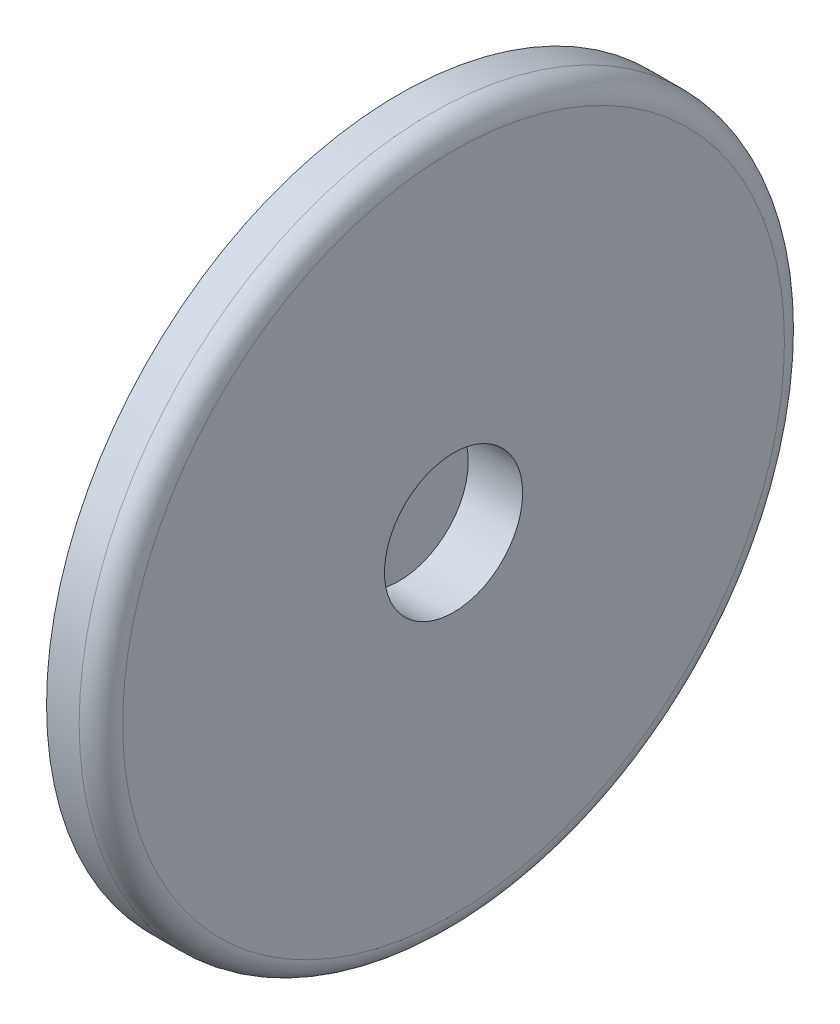
ISO-10303-21;
HEADER;
FILE_DESCRIPTION(('STEP AP214'),'2;1');
FILE_NAME('part.step','',(''),(''),'','','');
FILE_SCHEMA(('AUTOMOTIVE_DESIGN { 1 0 10303 214 1 1 1 1 }'));
ENDSEC;
DATA;
#1=APPLICATION_CONTEXT('core data for automotive mechanical design processes');
#2=APPLICATION_PROTOCOL_DEFINITION('international standard','automotive_design',2000,#1);
#3=PRODUCT_CONTEXT('',#1,'mechanical');
#4=PRODUCT('Part','Part','',(#3));
#5=PRODUCT_RELATED_PRODUCT_CATEGORY('part','',(#4));
#6=PRODUCT_DEFINITION_FORMATION('','',#4);
#7=PRODUCT_DEFINITION_CONTEXT('part definition',#1,'design');
#8=PRODUCT_DEFINITION('design','',#6,#7);
#9=PRODUCT_DEFINITION_SHAPE('','',#8);
#10=(LENGTH_UNIT() NAMED_UNIT(*) SI_UNIT(.MILLI.,.METRE.));
#11=(NAMED_UNIT(*) PLANE_ANGLE_UNIT() SI_UNIT($,.RADIAN.));
#12=(NAMED_UNIT(*) SI_UNIT($,.STERADIAN.) SOLID_ANGLE_UNIT());
#13=UNCERTAINTY_MEASURE_WITH_UNIT(LENGTH_MEASURE(1.E-05),#10,'distance_accuracy_value','');
#14=(GEOMETRIC_REPRESENTATION_CONTEXT(3) GLOBAL_UNCERTAINTY_ASSIGNED_CONTEXT((#13)) GLOBAL_UNIT_ASSIGNED_CONTEXT((#10,
#11,#12)) REPRESENTATION_CONTEXT('',''));
#15=CARTESIAN_POINT('',(0.,0.,0.));
#16=DIRECTION('',(0.,0.,1.));
#17=DIRECTION('',(1.,0.,0.));
#18=AXIS2_PLACEMENT_3D('',#15,#16,#17);
#19=CARTESIAN_POINT('',(10.,0.,0.));
#20=DIRECTION('',(-1.,0.,0.));
#21=DIRECTION('',(0.,0.,1.));
#22=AXIS2_PLACEMENT_3D('',#19,#20,#21);
#23=CYLINDRICAL_SURFACE('',#22,51.15);
#24=CARTESIAN_POINT('',(0.999999999999999,0.,0.));
#25=DIRECTION('',(1.,0.,0.));
#26=DIRECTION('',(0.,0.,-1.));
#27=AXIS2_PLACEMENT_3D('',#24,#25,#26);
#28=CIRCLE('',#27,51.15);
#29=CARTESIAN_POINT('',(0.999999999999999,0.,-51.15));
#30=VERTEX_POINT('',#29);
#31=EDGE_CURVE('E46',#30,#30,#28,.T.);
#32=ORIENTED_EDGE('',*,*,#31,.T.);
#33=EDGE_LOOP('',(#32));
#34=FACE_BOUND('',#33,.T.);
#35=CARTESIAN_POINT('',(10.,0.,0.));
#36=DIRECTION('',(1.,0.,0.));
#37=DIRECTION('',(0.,0.,-1.));
#38=AXIS2_PLACEMENT_3D('',#35,#36,#37);
#39=CIRCLE('',#38,51.15);
#40=CARTESIAN_POINT('',(10.,0.,-51.15));
#41=VERTEX_POINT('',#40);
#42=EDGE_CURVE('E51',#41,#41,#39,.T.);
#43=ORIENTED_EDGE('',*,*,#42,.F.);
#44=EDGE_LOOP('',(#43));
#45=FACE_BOUND('',#44,.T.);
#46=ADVANCED_FACE('F31',(#34,#45),#23,.T.);
#47=CARTESIAN_POINT('',(0.,0.,0.));
#48=DIRECTION('',(1.,0.,0.));
#49=DIRECTION('',(0.,0.,-1.));
#50=AXIS2_PLACEMENT_3D('',#47,#48,#49);
#51=PLANE('',#50);
#52=CARTESIAN_POINT('',(0.,0.,0.));
#53=DIRECTION('',(1.,0.,0.));
#54=DIRECTION('',(0.,0.,-1.));
#55=AXIS2_PLACEMENT_3D('',#52,#53,#54);
#56=CIRCLE('',#55,50.15);
#57=CARTESIAN_POINT('',(0.,0.,-50.15));
#58=VERTEX_POINT('',#57);
#59=EDGE_CURVE('E42',#58,#58,#56,.F.);
#60=ORIENTED_EDGE('',*,*,#59,.T.);
#61=EDGE_LOOP('',(#60));
#62=FACE_BOUND('',#61,.T.);
#63=ADVANCED_FACE('F83',(#62),#51,.F.);
#64=CARTESIAN_POINT('',(10.,0.,0.));
#65=DIRECTION('',(1.,0.,0.));
#66=DIRECTION('',(0.,0.,-1.));
#67=AXIS2_PLACEMENT_3D('',#64,#65,#66);
#68=PLANE('',#67);
#69=CARTESIAN_POINT('',(10.,0.,0.));
#70=DIRECTION('',(1.,0.,0.));
#71=DIRECTION('',(0.,0.,-1.));
#72=AXIS2_PLACEMENT_3D('',#69,#70,#71);
#73=CIRCLE('',#72,64.8485504898787);
#74=CARTESIAN_POINT('',(10.,0.,-64.8485504898787));
#75=VERTEX_POINT('',#74);
#76=EDGE_CURVE('E54',#75,#75,#73,.T.);
#77=ORIENTED_EDGE('',*,*,#76,.F.);
#78=EDGE_LOOP('',(#77));
#79=FACE_BOUND('',#78,.T.);
#80=ORIENTED_EDGE('',*,*,#42,.T.);
#81=EDGE_LOOP('',(#80));
#82=FACE_BOUND('',#81,.T.);
#83=ADVANCED_FACE('F79',(#79,#82),#68,.F.);
#84=CARTESIAN_POINT('',(20.,0.,0.));
#85=DIRECTION('',(-1.,0.,0.));
#86=DIRECTION('',(0.,0.,1.));
#87=AXIS2_PLACEMENT_3D('',#84,#85,#86);
#88=CYLINDRICAL_SURFACE('',#87,64.8485504898787);
#89=CARTESIAN_POINT('',(16.,0.,0.));
#90=DIRECTION('',(1.,0.,0.));
#91=DIRECTION('',(0.,0.,-1.));
#92=AXIS2_PLACEMENT_3D('',#89,#90,#91);
#93=CIRCLE('',#92,64.8485504898787);
#94=CARTESIAN_POINT('',(16.,0.,-64.8485504898787));
#95=VERTEX_POINT('',#94);
#96=EDGE_CURVE('E10',#95,#95,#93,.F.);
#97=ORIENTED_EDGE('',*,*,#96,.T.);
#98=EDGE_LOOP('',(#97));
#99=FACE_BOUND('',#98,.T.);
#100=ORIENTED_EDGE('',*,*,#76,.T.);
#101=EDGE_LOOP('',(#100));
#102=FACE_BOUND('',#101,.T.);
#103=ADVANCED_FACE('F74',(#99,#102),#88,.T.);
#104=CARTESIAN_POINT('',(20.,0.,0.));
#105=DIRECTION('',(1.,0.,0.));
#106=DIRECTION('',(0.,0.,-1.));
#107=AXIS2_PLACEMENT_3D('',#104,#105,#106);
#108=PLANE('',#107);
#109=CARTESIAN_POINT('',(20.,0.,0.));
#110=DIRECTION('',(1.,0.,0.));
#111=DIRECTION('',(0.,0.,-1.));
#112=AXIS2_PLACEMENT_3D('',#109,#110,#111);
#113=CIRCLE('',#112,60.8485504898787);
#114=CARTESIAN_POINT('',(20.,0.,-60.8485504898787));
#115=VERTEX_POINT('',#114);
#116=EDGE_CURVE('E38',#115,#115,#113,.T.);
#117=ORIENTED_EDGE('',*,*,#116,.T.);
#118=EDGE_LOOP('',(#117));
#119=FACE_BOUND('',#118,.T.);
#120=CARTESIAN_POINT('',(20.,0.,0.));
#121=DIRECTION('',(1.,0.,0.));
#122=DIRECTION('',(0.,0.,-1.));
#123=AXIS2_PLACEMENT_3D('',#120,#121,#122);
#124=CIRCLE('',#123,12.7);
#125=CARTESIAN_POINT('',(20.,0.,-12.7));
#126=VERTEX_POINT('',#125);
#127=EDGE_CURVE('E58',#126,#126,#124,.T.);
#128=ORIENTED_EDGE('',*,*,#127,.F.);
#129=EDGE_LOOP('',(#128));
#130=FACE_BOUND('',#129,.T.);
#131=ADVANCED_FACE('F69',(#119,#130),#108,.T.);
#132=CARTESIAN_POINT('',(10.,0.,0.));
#133=DIRECTION('',(1.,0.,0.));
#134=DIRECTION('',(0.,0.,-1.));
#135=AXIS2_PLACEMENT_3D('',#132,#133,#134);
#136=CYLINDRICAL_SURFACE('',#135,12.7);
#137=CARTESIAN_POINT('',(10.,0.,0.));
#138=DIRECTION('',(1.,0.,0.));
#139=DIRECTION('',(0.,0.,-1.));
#140=AXIS2_PLACEMENT_3D('',#137,#138,#139);
#141=CIRCLE('',#140,12.7);
#142=CARTESIAN_POINT('',(10.,0.,-12.7));
#143=VERTEX_POINT('',#142);
#144=EDGE_CURVE('E57',#143,#143,#141,.T.);
#145=ORIENTED_EDGE('',*,*,#144,.F.);
#146=EDGE_LOOP('',(#145));
#147=FACE_BOUND('',#146,.T.);
#148=ORIENTED_EDGE('',*,*,#127,.T.);
#149=EDGE_LOOP('',(#148));
#150=FACE_BOUND('',#149,.T.);
#151=ADVANCED_FACE('F66',(#147,#150),#136,.F.);
#152=CARTESIAN_POINT('',(10.,0.,0.));
#153=DIRECTION('',(1.,0.,0.));
#154=DIRECTION('',(0.,0.,-1.));
#155=AXIS2_PLACEMENT_3D('',#152,#153,#154);
#156=PLANE('',#155);
#157=ORIENTED_EDGE('',*,*,#144,.T.);
#158=EDGE_LOOP('',(#157));
#159=FACE_BOUND('',#158,.T.);
#160=ADVANCED_FACE('F64',(#159),#156,.T.);
#161=CARTESIAN_POINT('',(0.999999999999999,0.,0.));
#162=DIRECTION('',(1.,0.,0.));
#163=DIRECTION('',(0.,0.,-1.));
#164=AXIS2_PLACEMENT_3D('',#161,#162,#163);
#165=TOROIDAL_SURFACE('',#164,50.15,1.);
#166=ORIENTED_EDGE('',*,*,#59,.F.);
#167=EDGE_LOOP('',(#166));
#168=FACE_BOUND('',#167,.T.);
#169=ORIENTED_EDGE('',*,*,#31,.F.);
#170=EDGE_LOOP('',(#169));
#171=FACE_BOUND('',#170,.T.);
#172=ADVANCED_FACE('F92',(#168,#171),#165,.T.);
#173=CARTESIAN_POINT('',(16.,0.,0.));
#174=DIRECTION('',(1.,0.,0.));
#175=DIRECTION('',(0.,0.,-1.));
#176=AXIS2_PLACEMENT_3D('',#173,#174,#175);
#177=TOROIDAL_SURFACE('',#176,60.8485504898787,4.);
#178=ORIENTED_EDGE('',*,*,#96,.F.);
#179=EDGE_LOOP('',(#178));
#180=FACE_BOUND('',#179,.T.);
#181=ORIENTED_EDGE('',*,*,#116,.F.);
#182=EDGE_LOOP('',(#181));
#183=FACE_BOUND('',#182,.T.);
#184=ADVANCED_FACE('F33',(#180,#183),#177,.T.);
#185=CLOSED_SHELL('',(#46,#63,#83,#103,#131,#151,#160,#172,#184));
#186=MANIFOLD_SOLID_BREP('B2',#185);
#187=ADVANCED_BREP_SHAPE_REPRESENTATION('',(#18,#186),#14);
#188=SHAPE_DEFINITION_REPRESENTATION(#9,#187);
ENDSEC;
END-ISO-10303-21;
